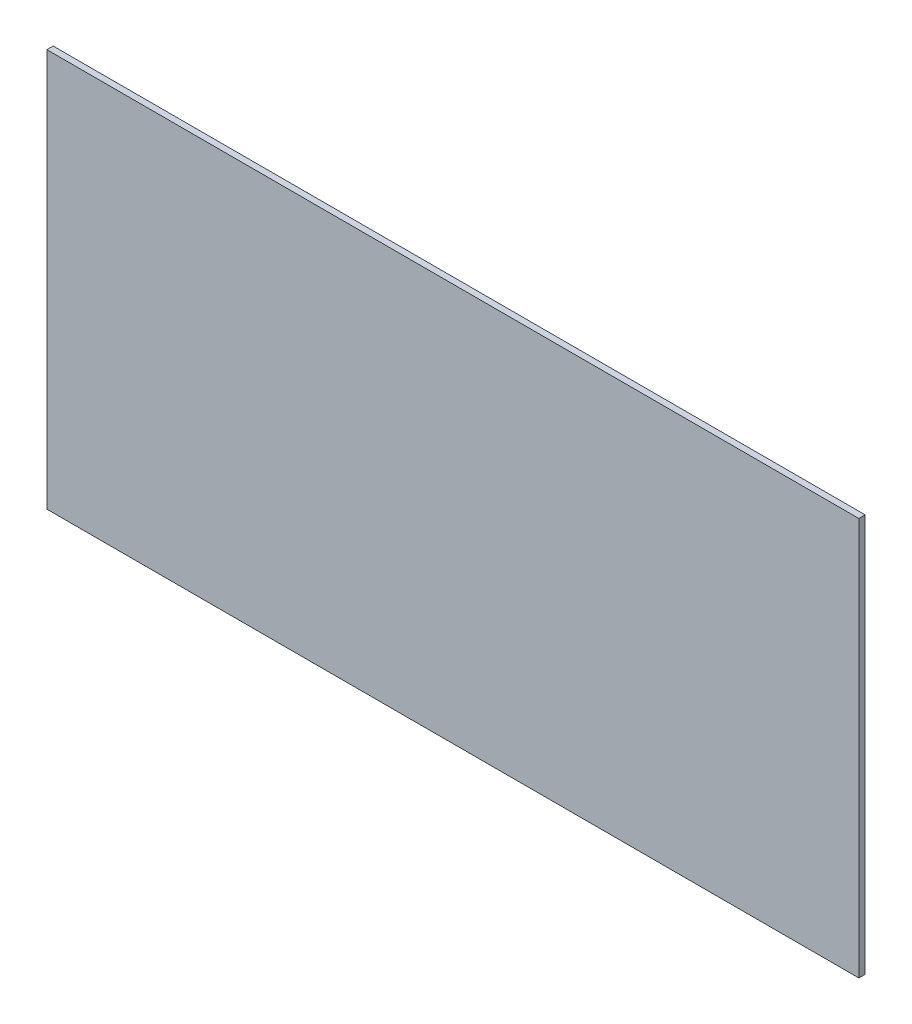
ISO-10303-21;
HEADER;
FILE_DESCRIPTION(('STEP AP214'),'2;1');
FILE_NAME('part.step','',(''),(''),'','','');
FILE_SCHEMA(('AUTOMOTIVE_DESIGN { 1 0 10303 214 1 1 1 1 }'));
ENDSEC;
DATA;
#1=APPLICATION_CONTEXT('core data for automotive mechanical design processes');
#2=APPLICATION_PROTOCOL_DEFINITION('international standard','automotive_design',2000,#1);
#3=PRODUCT_CONTEXT('',#1,'mechanical');
#4=PRODUCT('Part','Part','',(#3));
#5=PRODUCT_RELATED_PRODUCT_CATEGORY('part','',(#4));
#6=PRODUCT_DEFINITION_FORMATION('','',#4);
#7=PRODUCT_DEFINITION_CONTEXT('part definition',#1,'design');
#8=PRODUCT_DEFINITION('design','',#6,#7);
#9=PRODUCT_DEFINITION_SHAPE('','',#8);
#10=(LENGTH_UNIT() NAMED_UNIT(*) SI_UNIT(.MILLI.,.METRE.));
#11=(NAMED_UNIT(*) PLANE_ANGLE_UNIT() SI_UNIT($,.RADIAN.));
#12=(NAMED_UNIT(*) SI_UNIT($,.STERADIAN.) SOLID_ANGLE_UNIT());
#13=UNCERTAINTY_MEASURE_WITH_UNIT(LENGTH_MEASURE(1.E-05),#10,'distance_accuracy_value','');
#14=(GEOMETRIC_REPRESENTATION_CONTEXT(3) GLOBAL_UNCERTAINTY_ASSIGNED_CONTEXT((#13)) GLOBAL_UNIT_ASSIGNED_CONTEXT((#10,
#11,#12)) REPRESENTATION_CONTEXT('',''));
#15=CARTESIAN_POINT('',(0.,0.,0.));
#16=DIRECTION('',(0.,0.,1.));
#17=DIRECTION('',(1.,0.,0.));
#18=AXIS2_PLACEMENT_3D('',#15,#16,#17);
#19=CARTESIAN_POINT('',(289.5,-141.875,2.2479));
#20=DIRECTION('',(-1.,0.,0.));
#21=DIRECTION('',(0.,0.,1.));
#22=AXIS2_PLACEMENT_3D('',#19,#20,#21);
#23=PLANE('',#22);
#24=DIRECTION('',(0.,1.,0.));
#25=VECTOR('',#24,1.);
#26=CARTESIAN_POINT('',(289.5,-141.875,-2.2479));
#27=LINE('',#26,#25);
#28=CARTESIAN_POINT('',(289.5,-141.875,-2.2479));
#29=VERTEX_POINT('',#28);
#30=CARTESIAN_POINT('',(289.5,141.875,-2.2479));
#31=VERTEX_POINT('',#30);
#32=EDGE_CURVE('E96',#29,#31,#27,.T.);
#33=ORIENTED_EDGE('',*,*,#32,.T.);
#34=DIRECTION('',(0.,0.,-1.));
#35=VECTOR('',#34,1.);
#36=CARTESIAN_POINT('',(289.5,141.875,2.2479));
#37=LINE('',#36,#35);
#38=CARTESIAN_POINT('',(289.5,141.875,2.2479));
#39=VERTEX_POINT('',#38);
#40=EDGE_CURVE('E11',#39,#31,#37,.T.);
#41=ORIENTED_EDGE('',*,*,#40,.F.);
#42=DIRECTION('',(0.,1.,0.));
#43=VECTOR('',#42,1.);
#44=CARTESIAN_POINT('',(289.5,-141.875,2.2479));
#45=LINE('',#44,#43);
#46=CARTESIAN_POINT('',(289.5,-141.875,2.2479));
#47=VERTEX_POINT('',#46);
#48=EDGE_CURVE('E84',#47,#39,#45,.T.);
#49=ORIENTED_EDGE('',*,*,#48,.F.);
#50=DIRECTION('',(0.,0.,-1.));
#51=VECTOR('',#50,1.);
#52=CARTESIAN_POINT('',(289.5,-141.875,2.2479));
#53=LINE('',#52,#51);
#54=EDGE_CURVE('E92',#47,#29,#53,.T.);
#55=ORIENTED_EDGE('',*,*,#54,.T.);
#56=EDGE_LOOP('',(#33,#41,#49,#55));
#57=FACE_BOUND('',#56,.T.);
#58=ADVANCED_FACE('F33',(#57),#23,.F.);
#59=CARTESIAN_POINT('',(-289.5,141.875,2.2479));
#60=DIRECTION('',(0.,-1.,0.));
#61=DIRECTION('',(0.,0.,-1.));
#62=AXIS2_PLACEMENT_3D('',#59,#60,#61);
#63=PLANE('',#62);
#64=DIRECTION('',(-1.,0.,0.));
#65=VECTOR('',#64,1.);
#66=CARTESIAN_POINT('',(-289.5,141.875,-2.2479));
#67=LINE('',#66,#65);
#68=CARTESIAN_POINT('',(-289.5,141.875,-2.2479));
#69=VERTEX_POINT('',#68);
#70=EDGE_CURVE('E88',#31,#69,#67,.T.);
#71=ORIENTED_EDGE('',*,*,#70,.T.);
#72=DIRECTION('',(0.,0.,-1.));
#73=VECTOR('',#72,1.);
#74=CARTESIAN_POINT('',(-289.5,141.875,2.2479));
#75=LINE('',#74,#73);
#76=CARTESIAN_POINT('',(-289.5,141.875,2.2479));
#77=VERTEX_POINT('',#76);
#78=EDGE_CURVE('E41',#77,#69,#75,.T.);
#79=ORIENTED_EDGE('',*,*,#78,.F.);
#80=DIRECTION('',(-1.,0.,0.));
#81=VECTOR('',#80,1.);
#82=CARTESIAN_POINT('',(-289.5,141.875,2.2479));
#83=LINE('',#82,#81);
#84=EDGE_CURVE('E79',#39,#77,#83,.T.);
#85=ORIENTED_EDGE('',*,*,#84,.F.);
#86=ORIENTED_EDGE('',*,*,#40,.T.);
#87=EDGE_LOOP('',(#71,#79,#85,#86));
#88=FACE_BOUND('',#87,.T.);
#89=ADVANCED_FACE('F87',(#88),#63,.F.);
#90=CARTESIAN_POINT('',(-289.5,-141.875,2.2479));
#91=DIRECTION('',(1.,0.,0.));
#92=DIRECTION('',(0.,0.,-1.));
#93=AXIS2_PLACEMENT_3D('',#90,#91,#92);
#94=PLANE('',#93);
#95=DIRECTION('',(0.,-1.,0.));
#96=VECTOR('',#95,1.);
#97=CARTESIAN_POINT('',(-289.5,-141.875,-2.2479));
#98=LINE('',#97,#96);
#99=CARTESIAN_POINT('',(-289.5,-141.875,-2.2479));
#100=VERTEX_POINT('',#99);
#101=EDGE_CURVE('E66',#69,#100,#98,.T.);
#102=ORIENTED_EDGE('',*,*,#101,.T.);
#103=DIRECTION('',(0.,0.,-1.));
#104=VECTOR('',#103,1.);
#105=CARTESIAN_POINT('',(-289.5,-141.875,2.2479));
#106=LINE('',#105,#104);
#107=CARTESIAN_POINT('',(-289.5,-141.875,2.2479));
#108=VERTEX_POINT('',#107);
#109=EDGE_CURVE('E89',#108,#100,#106,.T.);
#110=ORIENTED_EDGE('',*,*,#109,.F.);
#111=DIRECTION('',(0.,-1.,0.));
#112=VECTOR('',#111,1.);
#113=CARTESIAN_POINT('',(-289.5,-141.875,2.2479));
#114=LINE('',#113,#112);
#115=EDGE_CURVE('E82',#77,#108,#114,.T.);
#116=ORIENTED_EDGE('',*,*,#115,.F.);
#117=ORIENTED_EDGE('',*,*,#78,.T.);
#118=EDGE_LOOP('',(#102,#110,#116,#117));
#119=FACE_BOUND('',#118,.T.);
#120=ADVANCED_FACE('F90',(#119),#94,.F.);
#121=CARTESIAN_POINT('',(-289.5,-141.875,2.2479));
#122=DIRECTION('',(0.,1.,0.));
#123=DIRECTION('',(0.,0.,1.));
#124=AXIS2_PLACEMENT_3D('',#121,#122,#123);
#125=PLANE('',#124);
#126=DIRECTION('',(1.,0.,0.));
#127=VECTOR('',#126,1.);
#128=CARTESIAN_POINT('',(-289.5,-141.875,-2.2479));
#129=LINE('',#128,#127);
#130=EDGE_CURVE('E72',#100,#29,#129,.T.);
#131=ORIENTED_EDGE('',*,*,#130,.T.);
#132=ORIENTED_EDGE('',*,*,#54,.F.);
#133=DIRECTION('',(1.,0.,0.));
#134=VECTOR('',#133,1.);
#135=CARTESIAN_POINT('',(-289.5,-141.875,2.2479));
#136=LINE('',#135,#134);
#137=EDGE_CURVE('E49',#108,#47,#136,.T.);
#138=ORIENTED_EDGE('',*,*,#137,.F.);
#139=ORIENTED_EDGE('',*,*,#109,.T.);
#140=EDGE_LOOP('',(#131,#132,#138,#139));
#141=FACE_BOUND('',#140,.T.);
#142=ADVANCED_FACE('F103',(#141),#125,.F.);
#143=CARTESIAN_POINT('',(0.,0.,2.2479));
#144=DIRECTION('',(0.,0.,-1.));
#145=DIRECTION('',(-1.,0.,0.));
#146=AXIS2_PLACEMENT_3D('',#143,#144,#145);
#147=PLANE('',#146);
#148=ORIENTED_EDGE('',*,*,#48,.T.);
#149=ORIENTED_EDGE('',*,*,#84,.T.);
#150=ORIENTED_EDGE('',*,*,#115,.T.);
#151=ORIENTED_EDGE('',*,*,#137,.T.);
#152=EDGE_LOOP('',(#148,#149,#150,#151));
#153=FACE_BOUND('',#152,.T.);
#154=ADVANCED_FACE('F80',(#153),#147,.F.);
#155=CARTESIAN_POINT('',(0.,0.,-2.2479));
#156=DIRECTION('',(0.,0.,-1.));
#157=DIRECTION('',(-1.,0.,0.));
#158=AXIS2_PLACEMENT_3D('',#155,#156,#157);
#159=PLANE('',#158);
#160=ORIENTED_EDGE('',*,*,#32,.F.);
#161=ORIENTED_EDGE('',*,*,#130,.F.);
#162=ORIENTED_EDGE('',*,*,#101,.F.);
#163=ORIENTED_EDGE('',*,*,#70,.F.);
#164=EDGE_LOOP('',(#160,#161,#162,#163));
#165=FACE_BOUND('',#164,.T.);
#166=ADVANCED_FACE('F106',(#165),#159,.T.);
#167=CLOSED_SHELL('',(#58,#89,#120,#142,#154,#166));
#168=MANIFOLD_SOLID_BREP('B2',#167);
#169=ADVANCED_BREP_SHAPE_REPRESENTATION('',(#18,#168),#14);
#170=SHAPE_DEFINITION_REPRESENTATION(#9,#169);
ENDSEC;
END-ISO-10303-21;
